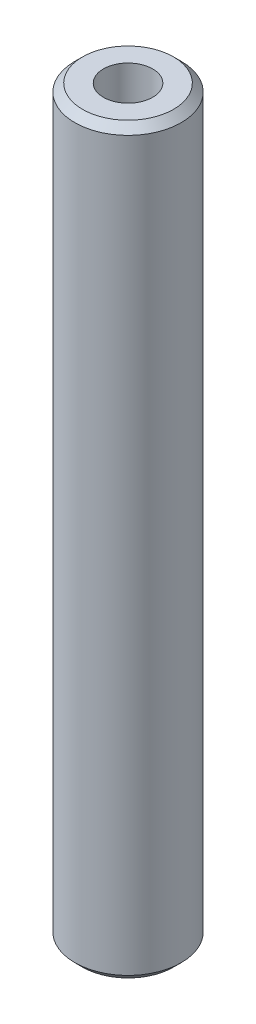
ISO-10303-21;
HEADER;
FILE_DESCRIPTION(('STEP AP214'),'2;1');
FILE_NAME('part.step','',(''),(''),'','','');
FILE_SCHEMA(('AUTOMOTIVE_DESIGN { 1 0 10303 214 1 1 1 1 }'));
ENDSEC;
DATA;
#1=APPLICATION_CONTEXT('core data for automotive mechanical design processes');
#2=APPLICATION_PROTOCOL_DEFINITION('international standard','automotive_design',2000,#1);
#3=PRODUCT_CONTEXT('',#1,'mechanical');
#4=PRODUCT('Part','Part','',(#3));
#5=PRODUCT_RELATED_PRODUCT_CATEGORY('part','',(#4));
#6=PRODUCT_DEFINITION_FORMATION('','',#4);
#7=PRODUCT_DEFINITION_CONTEXT('part definition',#1,'design');
#8=PRODUCT_DEFINITION('design','',#6,#7);
#9=PRODUCT_DEFINITION_SHAPE('','',#8);
#10=(LENGTH_UNIT() NAMED_UNIT(*) SI_UNIT(.MILLI.,.METRE.));
#11=(NAMED_UNIT(*) PLANE_ANGLE_UNIT() SI_UNIT($,.RADIAN.));
#12=(NAMED_UNIT(*) SI_UNIT($,.STERADIAN.) SOLID_ANGLE_UNIT());
#13=UNCERTAINTY_MEASURE_WITH_UNIT(LENGTH_MEASURE(1.E-05),#10,'distance_accuracy_value','');
#14=(GEOMETRIC_REPRESENTATION_CONTEXT(3) GLOBAL_UNCERTAINTY_ASSIGNED_CONTEXT((#13)) GLOBAL_UNIT_ASSIGNED_CONTEXT((#10,
#11,#12)) REPRESENTATION_CONTEXT('',''));
#15=CARTESIAN_POINT('',(0.,0.,0.));
#16=DIRECTION('',(0.,0.,1.));
#17=DIRECTION('',(1.,0.,0.));
#18=AXIS2_PLACEMENT_3D('',#15,#16,#17);
#19=CARTESIAN_POINT('',(0.,69.8446342871047,0.));
#20=DIRECTION('',(0.,-1.,0.));
#21=DIRECTION('',(0.,0.,-1.));
#22=AXIS2_PLACEMENT_3D('',#19,#20,#21);
#23=CYLINDRICAL_SURFACE('',#22,5.);
#24=CARTESIAN_POINT('',(0.,69.1220722766548,0.));
#25=DIRECTION('',(0.,1.,0.));
#26=DIRECTION('',(0.,0.,1.));
#27=AXIS2_PLACEMENT_3D('',#24,#25,#26);
#28=CIRCLE('',#27,5.);
#29=CARTESIAN_POINT('',(0.,69.1220722766548,-5.));
#30=VERTEX_POINT('',#29);
#31=EDGE_CURVE('E50',#30,#30,#28,.F.);
#32=CARTESIAN_POINT('',(0.,0.722562010449804,0.));
#33=DIRECTION('',(0.,1.,0.));
#34=DIRECTION('',(0.,0.,1.));
#35=AXIS2_PLACEMENT_3D('',#32,#33,#34);
#36=CIRCLE('',#35,5.);
#37=CARTESIAN_POINT('',(0.,0.722562010449804,-5.));
#38=VERTEX_POINT('',#37);
#39=EDGE_CURVE('E51',#38,#38,#36,.T.);
#40=CARTESIAN_POINT('',(0.,69.1220722766548,-5.));
#41=CARTESIAN_POINT('',(0.,68.4095773780485,-5.));
#42=CARTESIAN_POINT('',(0.,67.6970824794422,-5.));
#43=CARTESIAN_POINT('',(0.,66.2720926822296,-5.));
#44=CARTESIAN_POINT('',(0.,65.5595977836233,-5.));
#45=CARTESIAN_POINT('',(0.,64.1346079864107,-5.));
#46=CARTESIAN_POINT('',(0.,63.4221130878044,-5.));
#47=CARTESIAN_POINT('',(0.,61.9971232905918,-5.));
#48=CARTESIAN_POINT('',(0.,61.2846283919855,-5.));
#49=CARTESIAN_POINT('',(0.,59.8596385947729,-5.));
#50=CARTESIAN_POINT('',(0.,59.1471436961666,-5.));
#51=CARTESIAN_POINT('',(0.,57.722153898954,-5.));
#52=CARTESIAN_POINT('',(0.,57.0096590003477,-5.));
#53=CARTESIAN_POINT('',(0.,55.5846692031351,-5.));
#54=CARTESIAN_POINT('',(0.,54.8721743045288,-5.));
#55=CARTESIAN_POINT('',(0.,53.4471845073162,-5.));
#56=CARTESIAN_POINT('',(0.,52.7346896087099,-5.));
#57=CARTESIAN_POINT('',(0.,51.3096998114973,-5.));
#58=CARTESIAN_POINT('',(0.,50.597204912891,-5.));
#59=CARTESIAN_POINT('',(0.,49.1722151156784,-5.));
#60=CARTESIAN_POINT('',(0.,48.4597202170721,-5.));
#61=CARTESIAN_POINT('',(0.,47.0347304198595,-5.));
#62=CARTESIAN_POINT('',(0.,46.3222355212532,-5.));
#63=CARTESIAN_POINT('',(0.,44.8972457240406,-5.));
#64=CARTESIAN_POINT('',(0.,44.1847508254343,-5.));
#65=CARTESIAN_POINT('',(0.,42.7597610282216,-5.));
#66=CARTESIAN_POINT('',(0.,42.0472661296153,-5.));
#67=CARTESIAN_POINT('',(0.,40.6222763324027,-5.));
#68=CARTESIAN_POINT('',(0.,39.9097814337964,-5.));
#69=CARTESIAN_POINT('',(0.,38.4847916365838,-5.));
#70=CARTESIAN_POINT('',(0.,37.7722967379775,-5.));
#71=CARTESIAN_POINT('',(0.,36.3473069407649,-5.));
#72=CARTESIAN_POINT('',(0.,35.6348120421586,-5.));
#73=CARTESIAN_POINT('',(0.,34.209822244946,-5.));
#74=CARTESIAN_POINT('',(0.,33.4973273463397,-5.));
#75=CARTESIAN_POINT('',(0.,32.0723375491271,-5.));
#76=CARTESIAN_POINT('',(0.,31.3598426505208,-5.));
#77=CARTESIAN_POINT('',(0.,29.9348528533082,-5.));
#78=CARTESIAN_POINT('',(0.,29.2223579547019,-5.));
#79=CARTESIAN_POINT('',(0.,27.7973681574893,-5.));
#80=CARTESIAN_POINT('',(0.,27.084873258883,-5.));
#81=CARTESIAN_POINT('',(0.,25.6598834616704,-5.));
#82=CARTESIAN_POINT('',(0.,24.9473885630641,-5.));
#83=CARTESIAN_POINT('',(0.,23.5223987658515,-5.));
#84=CARTESIAN_POINT('',(0.,22.8099038672452,-5.));
#85=CARTESIAN_POINT('',(0.,21.3849140700326,-5.));
#86=CARTESIAN_POINT('',(0.,20.6724191714263,-5.));
#87=CARTESIAN_POINT('',(0.,19.2474293742137,-5.));
#88=CARTESIAN_POINT('',(0.,18.5349344756074,-5.));
#89=CARTESIAN_POINT('',(0.,17.1099446783948,-5.));
#90=CARTESIAN_POINT('',(0.,16.3974497797885,-5.));
#91=CARTESIAN_POINT('',(0.,14.9724599825759,-5.));
#92=CARTESIAN_POINT('',(0.,14.2599650839696,-5.));
#93=CARTESIAN_POINT('',(0.,12.834975286757,-5.));
#94=CARTESIAN_POINT('',(0.,12.1224803881506,-5.));
#95=CARTESIAN_POINT('',(0.,10.697490590938,-5.));
#96=CARTESIAN_POINT('',(0.,9.98499569233174,-5.));
#97=CARTESIAN_POINT('',(0.,8.56000589511914,-5.));
#98=CARTESIAN_POINT('',(0.,7.84751099651283,-5.));
#99=CARTESIAN_POINT('',(0.,6.42252119930022,-5.));
#100=CARTESIAN_POINT('',(0.,5.71002630069393,-5.));
#101=CARTESIAN_POINT('',(0.,4.28503650348133,-5.));
#102=CARTESIAN_POINT('',(0.,3.57254160487503,-5.));
#103=CARTESIAN_POINT('',(0.,2.14755180766242,-5.));
#104=CARTESIAN_POINT('',(0.,1.43505690905611,-5.));
#105=CARTESIAN_POINT('',(0.,0.722562010449804,-5.));
#106=B_SPLINE_CURVE_WITH_KNOTS('',3,(#40,#41,#42,#43,#44,#45,#46,#47,#48,#49,#50,#51,#52,#53,
#54,#55,#56,#57,#58,#59,#60,#61,#62,#63,#64,#65,#66,#67,#68,#69,#70,#71,#72,#73,#74,#75,#76,#77,
#78,#79,#80,#81,#82,#83,#84,#85,#86,#87,#88,#89,#90,#91,#92,#93,#94,#95,#96,#97,#98,#99,#100,
#101,#102,#103,#104,#105),.UNSPECIFIED.,.F.,.F.,(4,2,2,2,2,2,2,2,2,2,2,2,2,2,2,2,2,2,2,2,2,2,2,
2,2,2,2,2,2,2,2,2,4),(0.,2.13748469581891,4.27496939163782,6.41245408745673,8.54993878327563,
10.6874234790945,12.8249081749134,14.9623928707324,17.0998775665513,19.2373622623702,
21.3748469581891,23.512331654008,25.6498163498269,27.7873010456458,29.9247857414647,
32.0622704372836,34.1997551331025,36.3372398289214,38.4747245247403,40.6122092205592,
42.7496939163781,44.8871786121971,47.024663308016,49.1621480038349,51.2996326996538,
53.4371173954727,55.5746020912916,57.7120867871105,59.8495714829294,61.9870561787483,
64.1245408745672,66.2620255703861,68.399510266205),.UNSPECIFIED.);
#107=EDGE_CURVE('BSEAM39',#30,#38,#106,.T.);
#108=ORIENTED_EDGE('',*,*,#31,.T.);
#109=ORIENTED_EDGE('',*,*,#39,.T.);
#110=ORIENTED_EDGE('',*,*,#107,.T.);
#111=ORIENTED_EDGE('',*,*,#107,.F.);
#112=EDGE_LOOP('',(#108,#110,#109,#111));
#113=FACE_BOUND('',#112,.T.);
#114=ADVANCED_FACE('F39',(#113),#23,.T.);
#115=CARTESIAN_POINT('',(0.,69.8446342871047,0.));
#116=DIRECTION('',(0.,1.,0.));
#117=DIRECTION('',(0.,0.,1.));
#118=AXIS2_PLACEMENT_3D('',#115,#116,#117);
#119=PLANE('',#118);
#120=CARTESIAN_POINT('',(0.,69.8446342871047,0.));
#121=DIRECTION('',(0.,1.,0.));
#122=DIRECTION('',(0.,0.,1.));
#123=AXIS2_PLACEMENT_3D('',#120,#121,#122);
#124=CIRCLE('',#123,4.2774379895502);
#125=CARTESIAN_POINT('',(0.,69.8446342871046,-4.27743798955021));
#126=VERTEX_POINT('',#125);
#127=EDGE_CURVE('E54',#126,#126,#124,.T.);
#128=ORIENTED_EDGE('',*,*,#127,.T.);
#129=EDGE_LOOP('',(#128));
#130=FACE_BOUND('',#129,.T.);
#131=CARTESIAN_POINT('',(0.,69.8446342871047,0.));
#132=DIRECTION('',(0.,1.,0.));
#133=DIRECTION('',(0.,0.,1.));
#134=AXIS2_PLACEMENT_3D('',#131,#132,#133);
#135=CIRCLE('',#134,2.31579114988999);
#136=CARTESIAN_POINT('',(0.,69.8446342871047,2.31579114988999));
#137=VERTEX_POINT('',#136);
#138=EDGE_CURVE('E58',#137,#137,#135,.T.);
#139=ORIENTED_EDGE('',*,*,#138,.F.);
#140=EDGE_LOOP('',(#139));
#141=FACE_BOUND('',#140,.T.);
#142=ADVANCED_FACE('F69',(#130,#141),#119,.T.);
#143=CARTESIAN_POINT('',(0.,0.,0.));
#144=DIRECTION('',(0.,1.,0.));
#145=DIRECTION('',(0.,0.,1.));
#146=AXIS2_PLACEMENT_3D('',#143,#144,#145);
#147=PLANE('',#146);
#148=CARTESIAN_POINT('',(0.,0.,0.));
#149=DIRECTION('',(0.,1.,0.));
#150=DIRECTION('',(0.,0.,1.));
#151=AXIS2_PLACEMENT_3D('',#148,#149,#150);
#152=CIRCLE('',#151,4.27743798955019);
#153=CARTESIAN_POINT('',(0.,0.,4.27743798955019));
#154=VERTEX_POINT('',#153);
#155=EDGE_CURVE('E10',#154,#154,#152,.F.);
#156=ORIENTED_EDGE('',*,*,#155,.T.);
#157=EDGE_LOOP('',(#156));
#158=FACE_BOUND('',#157,.T.);
#159=CARTESIAN_POINT('',(0.,0.,0.));
#160=DIRECTION('',(0.,1.,0.));
#161=DIRECTION('',(0.,0.,1.));
#162=AXIS2_PLACEMENT_3D('',#159,#160,#161);
#163=CIRCLE('',#162,2.31579114988999);
#164=CARTESIAN_POINT('',(0.,0.,2.31579114988999));
#165=VERTEX_POINT('',#164);
#166=EDGE_CURVE('E63',#165,#165,#163,.T.);
#167=ORIENTED_EDGE('',*,*,#166,.T.);
#168=EDGE_LOOP('',(#167));
#169=FACE_BOUND('',#168,.T.);
#170=ADVANCED_FACE('F75',(#158,#169),#147,.F.);
#171=CARTESIAN_POINT('',(0.,69.8446342871047,0.));
#172=DIRECTION('',(0.,-1.,0.));
#173=DIRECTION('',(0.,0.,-1.));
#174=AXIS2_PLACEMENT_3D('',#171,#172,#173);
#175=CYLINDRICAL_SURFACE('',#174,2.31579114988999);
#176=ORIENTED_EDGE('',*,*,#138,.T.);
#177=EDGE_LOOP('',(#176));
#178=FACE_BOUND('',#177,.T.);
#179=ORIENTED_EDGE('',*,*,#166,.F.);
#180=EDGE_LOOP('',(#179));
#181=FACE_BOUND('',#180,.T.);
#182=ADVANCED_FACE('F70',(#178,#181),#175,.F.);
#183=CARTESIAN_POINT('',(0.,69.8446342871047,0.));
#184=DIRECTION('',(0.,-1.,0.));
#185=DIRECTION('',(0.,0.,-1.));
#186=AXIS2_PLACEMENT_3D('',#183,#184,#185);
#187=CONICAL_SURFACE('',#186,4.2774379895502,0.785398163397445);
#188=CARTESIAN_POINT('',(0.,69.1220722766548,-5.00000000000001));
#189=CARTESIAN_POINT('',(0.,69.1295989642637,-4.99247331239116));
#190=CARTESIAN_POINT('',(0.,69.1371256518725,-4.9849466247823));
#191=CARTESIAN_POINT('',(0.,69.1521790270902,-4.9698932495646));
#192=CARTESIAN_POINT('',(0.,69.1597057146991,-4.96236656195575));
#193=CARTESIAN_POINT('',(0.,69.1747590899168,-4.94731318673804));
#194=CARTESIAN_POINT('',(0.,69.1822857775256,-4.93978649912919));
#195=CARTESIAN_POINT('',(0.,69.1973391527434,-4.92473312391149));
#196=CARTESIAN_POINT('',(0.,69.2048658403522,-4.91720643630263));
#197=CARTESIAN_POINT('',(0.,69.2199192155699,-4.90215306108493));
#198=CARTESIAN_POINT('',(0.,69.2274459031788,-4.89462637347608));
#199=CARTESIAN_POINT('',(0.,69.2424992783965,-4.87957299825837));
#200=CARTESIAN_POINT('',(0.,69.2500259660053,-4.87204631064952));
#201=CARTESIAN_POINT('',(0.,69.265079341223,-4.85699293543182));
#202=CARTESIAN_POINT('',(0.,69.2726060288319,-4.84946624782297));
#203=CARTESIAN_POINT('',(0.,69.2876594040496,-4.83441287260526));
#204=CARTESIAN_POINT('',(0.,69.2951860916584,-4.82688618499641));
#205=CARTESIAN_POINT('',(0.,69.3102394668761,-4.8118328097787));
#206=CARTESIAN_POINT('',(0.,69.317766154485,-4.80430612216985));
#207=CARTESIAN_POINT('',(0.,69.3328195297027,-4.78925274695215));
#208=CARTESIAN_POINT('',(0.,69.3403462173115,-4.7817260593433));
#209=CARTESIAN_POINT('',(0.,69.3553995925293,-4.76667268412559));
#210=CARTESIAN_POINT('',(0.,69.3629262801381,-4.75914599651674));
#211=CARTESIAN_POINT('',(0.,69.3779796553558,-4.74409262129903));
#212=CARTESIAN_POINT('',(0.,69.3855063429647,-4.73656593369018));
#213=CARTESIAN_POINT('',(0.,69.4005597181824,-4.72151255847248));
#214=CARTESIAN_POINT('',(0.,69.4080864057912,-4.71398587086363));
#215=CARTESIAN_POINT('',(0.,69.4231397810089,-4.69893249564592));
#216=CARTESIAN_POINT('',(0.,69.4306664686178,-4.69140580803707));
#217=CARTESIAN_POINT('',(0.,69.4457198438355,-4.67635243281937));
#218=CARTESIAN_POINT('',(0.,69.4532465314443,-4.66882574521052));
#219=CARTESIAN_POINT('',(0.,69.468299906662,-4.65377236999281));
#220=CARTESIAN_POINT('',(0.,69.4758265942709,-4.64624568238396));
#221=CARTESIAN_POINT('',(0.,69.4908799694886,-4.63119230716626));
#222=CARTESIAN_POINT('',(0.,69.4984066570974,-4.6236656195574));
#223=CARTESIAN_POINT('',(0.,69.5134600323152,-4.6086122443397));
#224=CARTESIAN_POINT('',(0.,69.520986719924,-4.60108555673085));
#225=CARTESIAN_POINT('',(0.,69.5360400951417,-4.58603218151314));
#226=CARTESIAN_POINT('',(0.,69.5435667827506,-4.57850549390429));
#227=CARTESIAN_POINT('',(0.,69.5586201579683,-4.56345211868659));
#228=CARTESIAN_POINT('',(0.,69.5661468455771,-4.55592543107773));
#229=CARTESIAN_POINT('',(0.,69.5812002207948,-4.54087205586003));
#230=CARTESIAN_POINT('',(0.,69.5887269084037,-4.53334536825118));
#231=CARTESIAN_POINT('',(0.,69.6037802836214,-4.51829199303348));
#232=CARTESIAN_POINT('',(0.,69.6113069712302,-4.51076530542462));
#233=CARTESIAN_POINT('',(0.,69.6263603464479,-4.49571193020692));
#234=CARTESIAN_POINT('',(0.,69.6338870340568,-4.48818524259807));
#235=CARTESIAN_POINT('',(0.,69.6489404092745,-4.47313186738036));
#236=CARTESIAN_POINT('',(0.,69.6564670968833,-4.46560517977151));
#237=CARTESIAN_POINT('',(0.,69.671520472101,-4.4505518045538));
#238=CARTESIAN_POINT('',(0.,69.6790471597099,-4.44302511694495));
#239=CARTESIAN_POINT('',(0.,69.6941005349276,-4.42797174172725));
#240=CARTESIAN_POINT('',(0.,69.7016272225364,-4.4204450541184));
#241=CARTESIAN_POINT('',(0.,69.7166805977541,-4.40539167890069));
#242=CARTESIAN_POINT('',(0.,69.724207285363,-4.39786499129184));
#243=CARTESIAN_POINT('',(0.,69.7392606605807,-4.38281161607414));
#244=CARTESIAN_POINT('',(0.,69.7467873481896,-4.37528492846528));
#245=CARTESIAN_POINT('',(0.,69.7618407234073,-4.36023155324758));
#246=CARTESIAN_POINT('',(0.,69.7693674110161,-4.35270486563873));
#247=CARTESIAN_POINT('',(0.,69.7844207862338,-4.33765149042102));
#248=CARTESIAN_POINT('',(0.,69.7919474738427,-4.33012480281217));
#249=CARTESIAN_POINT('',(0.,69.8070008490604,-4.31507142759447));
#250=CARTESIAN_POINT('',(0.,69.8145275366692,-4.30754473998562));
#251=CARTESIAN_POINT('',(0.,69.8295809118869,-4.29249136476791));
#252=CARTESIAN_POINT('',(0.,69.8371075994958,-4.28496467715906));
#253=CARTESIAN_POINT('',(0.,69.8446342871047,-4.27743798955021));
#254=B_SPLINE_CURVE_WITH_KNOTS('',3,(#188,#189,#190,#191,#192,#193,#194,#195,#196,#197,#198,
#199,#200,#201,#202,#203,#204,#205,#206,#207,#208,#209,#210,#211,#212,#213,#214,#215,#216,#217,
#218,#219,#220,#221,#222,#223,#224,#225,#226,#227,#228,#229,#230,#231,#232,#233,#234,#235,#236,
#237,#238,#239,#240,#241,#242,#243,#244,#245,#246,#247,#248,#249,#250,#251,#252,#253),
.UNSPECIFIED.,.F.,.F.,(4,2,2,2,2,2,2,2,2,2,2,2,2,2,2,2,2,2,2,2,2,2,2,2,2,2,2,2,2,2,2,2,4),(0.,
0.0319330310885532,0.0638660621771064,0.0957990932656602,0.127732124354213,0.159665155442767,
0.19159818653132,0.223531217619874,0.255464248708427,0.28739727979698,0.319330310885534,
0.351263341974078,0.383196373062631,0.415129404151184,0.447062435239738,0.478995466328291,
0.510928497416844,0.542861528505398,0.574794559593951,0.606727590682504,0.638660621771058,
0.670593652859611,0.702526683948155,0.734459715036708,0.766392746125262,0.798325777213815,
0.830258808302369,0.862191839390922,0.894124870479476,0.926057901568029,0.957990932656582,
0.989923963745136,1.02185699483369),.UNSPECIFIED.);
#255=EDGE_CURVE('BSEAM81',#30,#126,#254,.T.);
#256=ORIENTED_EDGE('',*,*,#31,.F.);
#257=ORIENTED_EDGE('',*,*,#127,.F.);
#258=ORIENTED_EDGE('',*,*,#255,.T.);
#259=ORIENTED_EDGE('',*,*,#255,.F.);
#260=EDGE_LOOP('',(#256,#258,#257,#259));
#261=FACE_BOUND('',#260,.T.);
#262=ADVANCED_FACE('F81',(#261),#187,.T.);
#263=CARTESIAN_POINT('',(0.,0.722562010449804,0.));
#264=DIRECTION('',(0.,1.,0.));
#265=DIRECTION('',(0.,0.,1.));
#266=AXIS2_PLACEMENT_3D('',#263,#264,#265);
#267=CONICAL_SURFACE('',#266,5.,0.78539816339745);
#268=ORIENTED_EDGE('',*,*,#155,.F.);
#269=EDGE_LOOP('',(#268));
#270=FACE_BOUND('',#269,.T.);
#271=ORIENTED_EDGE('',*,*,#39,.F.);
#272=EDGE_LOOP('',(#271));
#273=FACE_BOUND('',#272,.T.);
#274=ADVANCED_FACE('F45',(#270,#273),#267,.T.);
#275=CLOSED_SHELL('',(#114,#142,#170,#182,#262,#274));
#276=MANIFOLD_SOLID_BREP('B2',#275);
#277=ADVANCED_BREP_SHAPE_REPRESENTATION('',(#18,#276),#14);
#278=SHAPE_DEFINITION_REPRESENTATION(#9,#277);
ENDSEC;
END-ISO-10303-21;
